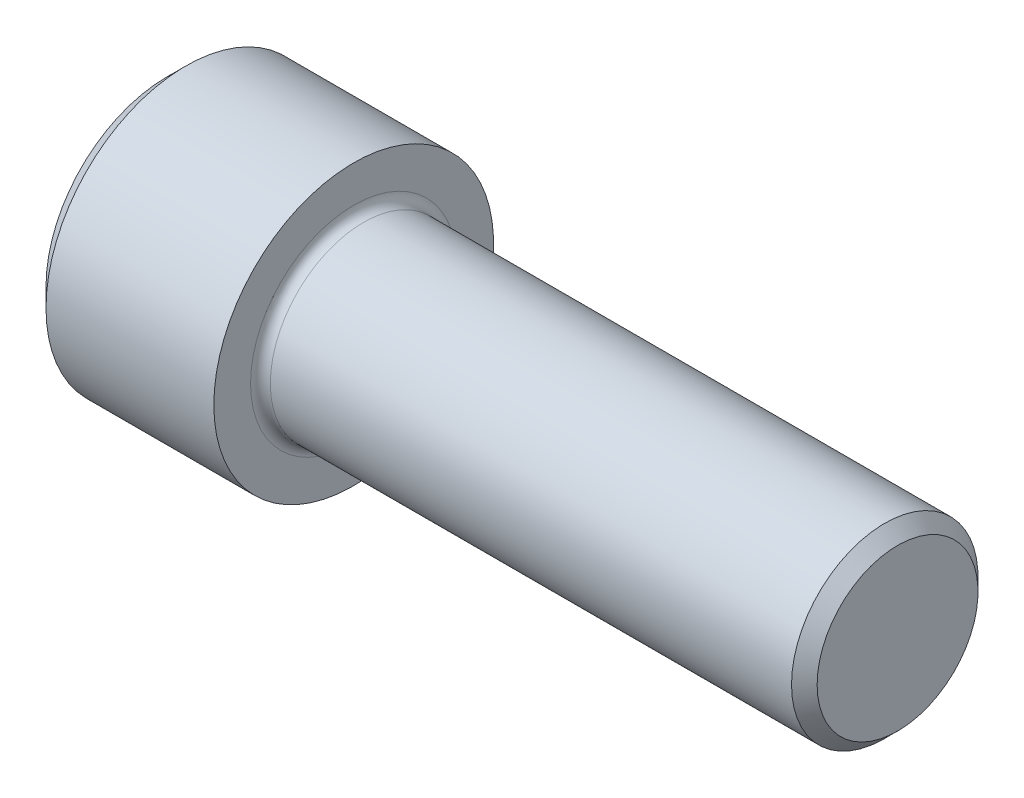
ISO-10303-21;
HEADER;
FILE_DESCRIPTION(('STEP AP214'),'2;1');
FILE_NAME('part.step','',(''),(''),'','','');
FILE_SCHEMA(('AUTOMOTIVE_DESIGN { 1 0 10303 214 1 1 1 1 }'));
ENDSEC;
DATA;
#1=APPLICATION_CONTEXT('core data for automotive mechanical design processes');
#2=APPLICATION_PROTOCOL_DEFINITION('international standard','automotive_design',2000,#1);
#3=PRODUCT_CONTEXT('',#1,'mechanical');
#4=PRODUCT('Part','Part','',(#3));
#5=PRODUCT_RELATED_PRODUCT_CATEGORY('part','',(#4));
#6=PRODUCT_DEFINITION_FORMATION('','',#4);
#7=PRODUCT_DEFINITION_CONTEXT('part definition',#1,'design');
#8=PRODUCT_DEFINITION('design','',#6,#7);
#9=PRODUCT_DEFINITION_SHAPE('','',#8);
#10=(LENGTH_UNIT() NAMED_UNIT(*) SI_UNIT(.MILLI.,.METRE.));
#11=(NAMED_UNIT(*) PLANE_ANGLE_UNIT() SI_UNIT($,.RADIAN.));
#12=(NAMED_UNIT(*) SI_UNIT($,.STERADIAN.) SOLID_ANGLE_UNIT());
#13=UNCERTAINTY_MEASURE_WITH_UNIT(LENGTH_MEASURE(1.E-05),#10,'distance_accuracy_value','');
#14=(GEOMETRIC_REPRESENTATION_CONTEXT(3) GLOBAL_UNCERTAINTY_ASSIGNED_CONTEXT((#13)) GLOBAL_UNIT_ASSIGNED_CONTEXT((#10,
#11,#12)) REPRESENTATION_CONTEXT('',''));
#15=CARTESIAN_POINT('',(0.,0.,0.));
#16=DIRECTION('',(0.,0.,1.));
#17=DIRECTION('',(1.,0.,0.));
#18=AXIS2_PLACEMENT_3D('',#15,#16,#17);
#19=CARTESIAN_POINT('',(0.,0.,0.));
#20=DIRECTION('',(-1.,0.,0.));
#21=DIRECTION('',(0.,0.,1.));
#22=AXIS2_PLACEMENT_3D('',#19,#20,#21);
#23=PLANE('',#22);
#24=DIRECTION('',(0.,-0.499999999999999,0.866025403784439));
#25=VECTOR('',#24,1.);
#26=CARTESIAN_POINT('',(0.,10.9696551146029,0.));
#27=LINE('',#26,#25);
#28=CARTESIAN_POINT('',(0.,10.9696551146029,0.));
#29=VERTEX_POINT('',#28);
#30=CARTESIAN_POINT('',(0.,5.48482755730145,9.49999999999999));
#31=VERTEX_POINT('',#30);
#32=EDGE_CURVE('E429',#29,#31,#27,.T.);
#33=ORIENTED_EDGE('',*,*,#32,.T.);
#34=DIRECTION('',(0.,1.,0.));
#35=VECTOR('',#34,1.);
#36=CARTESIAN_POINT('',(0.,-5.48482755730143,9.5));
#37=LINE('',#36,#35);
#38=CARTESIAN_POINT('',(0.,-5.48482755730143,9.5));
#39=VERTEX_POINT('',#38);
#40=EDGE_CURVE('E130',#39,#31,#37,.T.);
#41=ORIENTED_EDGE('',*,*,#40,.F.);
#42=DIRECTION('',(0.,-0.500000000000001,-0.866025403784438));
#43=VECTOR('',#42,1.);
#44=CARTESIAN_POINT('',(0.,-5.48482755730143,9.5));
#45=LINE('',#44,#43);
#46=CARTESIAN_POINT('',(0.,-10.9696551146029,0.));
#47=VERTEX_POINT('',#46);
#48=EDGE_CURVE('E432',#39,#47,#45,.T.);
#49=ORIENTED_EDGE('',*,*,#48,.T.);
#50=DIRECTION('',(0.,0.499999999999999,-0.866025403784439));
#51=VECTOR('',#50,1.);
#52=CARTESIAN_POINT('',(0.,-10.9696551146029,0.));
#53=LINE('',#52,#51);
#54=CARTESIAN_POINT('',(0.,-5.48482755730146,-9.49999999999999));
#55=VERTEX_POINT('',#54);
#56=EDGE_CURVE('E435',#47,#55,#53,.T.);
#57=ORIENTED_EDGE('',*,*,#56,.T.);
#58=DIRECTION('',(0.,-1.,0.));
#59=VECTOR('',#58,1.);
#60=CARTESIAN_POINT('',(0.,5.48482755730143,-9.50000000000001));
#61=LINE('',#60,#59);
#62=CARTESIAN_POINT('',(0.,5.48482755730143,-9.50000000000001));
#63=VERTEX_POINT('',#62);
#64=EDGE_CURVE('E438',#63,#55,#61,.T.);
#65=ORIENTED_EDGE('',*,*,#64,.F.);
#66=DIRECTION('',(0.,-0.500000000000001,-0.866025403784438));
#67=VECTOR('',#66,1.);
#68=CARTESIAN_POINT('',(0.,10.9696551146029,0.));
#69=LINE('',#68,#67);
#70=EDGE_CURVE('E125',#29,#63,#69,.T.);
#71=ORIENTED_EDGE('',*,*,#70,.F.);
#72=EDGE_LOOP('',(#33,#41,#49,#57,#65,#71));
#73=FACE_BOUND('',#72,.T.);
#74=CARTESIAN_POINT('',(0.,0.,0.));
#75=DIRECTION('',(-1.,0.,0.));
#76=DIRECTION('',(0.,0.,1.));
#77=AXIS2_PLACEMENT_3D('',#74,#75,#76);
#78=CIRCLE('',#77,15.6);
#79=CARTESIAN_POINT('',(0.,0.,15.6));
#80=VERTEX_POINT('',#79);
#81=EDGE_CURVE('E141',#80,#80,#78,.T.);
#82=ORIENTED_EDGE('',*,*,#81,.T.);
#83=EDGE_LOOP('',(#82));
#84=FACE_BOUND('',#83,.T.);
#85=ADVANCED_FACE('F38',(#73,#84),#23,.T.);
#86=CARTESIAN_POINT('',(94.,10.352,0.));
#87=DIRECTION('',(1.,0.,0.));
#88=DIRECTION('',(0.,0.,-1.));
#89=AXIS2_PLACEMENT_3D('',#86,#87,#88);
#90=PLANE('',#89);
#91=CARTESIAN_POINT('',(94.,0.,0.));
#92=DIRECTION('',(-1.,0.,0.));
#93=DIRECTION('',(0.,0.,1.));
#94=AXIS2_PLACEMENT_3D('',#91,#92,#93);
#95=CIRCLE('',#94,10.352);
#96=CARTESIAN_POINT('',(94.,0.,10.352));
#97=VERTEX_POINT('',#96);
#98=EDGE_CURVE('E154',#97,#97,#95,.T.);
#99=ORIENTED_EDGE('',*,*,#98,.F.);
#100=EDGE_LOOP('',(#99));
#101=FACE_BOUND('',#100,.T.);
#102=ADVANCED_FACE('F175',(#101),#90,.T.);
#103=CARTESIAN_POINT('',(94.,0.,0.));
#104=DIRECTION('',(-1.,0.,0.));
#105=DIRECTION('',(0.,0.,1.));
#106=AXIS2_PLACEMENT_3D('',#103,#104,#105);
#107=CONICAL_SURFACE('',#106,10.352,0.78539816339734);
#108=CARTESIAN_POINT('',(92.3519999999997,0.,0.));
#109=DIRECTION('',(-1.,0.,0.));
#110=DIRECTION('',(0.,0.,1.));
#111=AXIS2_PLACEMENT_3D('',#108,#109,#110);
#112=CIRCLE('',#111,12.);
#113=CARTESIAN_POINT('',(92.3519999999997,0.,12.));
#114=VERTEX_POINT('',#113);
#115=EDGE_CURVE('E151',#114,#114,#112,.T.);
#116=ORIENTED_EDGE('',*,*,#115,.F.);
#117=EDGE_LOOP('',(#116));
#118=FACE_BOUND('',#117,.T.);
#119=ORIENTED_EDGE('',*,*,#98,.T.);
#120=EDGE_LOOP('',(#119));
#121=FACE_BOUND('',#120,.T.);
#122=ADVANCED_FACE('F181',(#118,#121),#107,.T.);
#123=CARTESIAN_POINT('',(-31.75,0.,0.));
#124=DIRECTION('',(-1.,0.,0.));
#125=DIRECTION('',(0.,0.,1.));
#126=AXIS2_PLACEMENT_3D('',#123,#124,#125);
#127=CYLINDRICAL_SURFACE('',#126,12.);
#128=CARTESIAN_POINT('',(25.27,0.,0.));
#129=DIRECTION('',(1.,0.,0.));
#130=DIRECTION('',(0.,0.,-1.));
#131=AXIS2_PLACEMENT_3D('',#128,#129,#130);
#132=CIRCLE('',#131,12.);
#133=CARTESIAN_POINT('',(25.27,0.,-12.));
#134=VERTEX_POINT('',#133);
#135=EDGE_CURVE('E11',#134,#134,#132,.T.);
#136=ORIENTED_EDGE('',*,*,#135,.T.);
#137=EDGE_LOOP('',(#136));
#138=FACE_BOUND('',#137,.T.);
#139=ORIENTED_EDGE('',*,*,#115,.T.);
#140=EDGE_LOOP('',(#139));
#141=FACE_BOUND('',#140,.T.);
#142=ADVANCED_FACE('F192',(#138,#141),#127,.T.);
#143=CARTESIAN_POINT('',(24.,18.,0.));
#144=DIRECTION('',(1.,0.,0.));
#145=DIRECTION('',(0.,0.,-1.));
#146=AXIS2_PLACEMENT_3D('',#143,#144,#145);
#147=PLANE('',#146);
#148=CARTESIAN_POINT('',(24.,0.,0.));
#149=DIRECTION('',(1.,0.,0.));
#150=DIRECTION('',(0.,0.,-1.));
#151=AXIS2_PLACEMENT_3D('',#148,#149,#150);
#152=CIRCLE('',#151,13.27);
#153=CARTESIAN_POINT('',(24.,0.,-13.27));
#154=VERTEX_POINT('',#153);
#155=EDGE_CURVE('E46',#154,#154,#152,.F.);
#156=ORIENTED_EDGE('',*,*,#155,.T.);
#157=EDGE_LOOP('',(#156));
#158=FACE_BOUND('',#157,.T.);
#159=CARTESIAN_POINT('',(24.,0.,0.));
#160=DIRECTION('',(-1.,0.,0.));
#161=DIRECTION('',(0.,0.,1.));
#162=AXIS2_PLACEMENT_3D('',#159,#160,#161);
#163=CIRCLE('',#162,18.);
#164=CARTESIAN_POINT('',(24.,0.,18.));
#165=VERTEX_POINT('',#164);
#166=EDGE_CURVE('E148',#165,#165,#163,.T.);
#167=ORIENTED_EDGE('',*,*,#166,.F.);
#168=EDGE_LOOP('',(#167));
#169=FACE_BOUND('',#168,.T.);
#170=ADVANCED_FACE('F159',(#158,#169),#147,.T.);
#171=CARTESIAN_POINT('',(-31.75,0.,0.));
#172=DIRECTION('',(-1.,0.,0.));
#173=DIRECTION('',(0.,0.,1.));
#174=AXIS2_PLACEMENT_3D('',#171,#172,#173);
#175=CYLINDRICAL_SURFACE('',#174,18.);
#176=ORIENTED_EDGE('',*,*,#166,.T.);
#177=EDGE_LOOP('',(#176));
#178=FACE_BOUND('',#177,.T.);
#179=CARTESIAN_POINT('',(2.4,0.,0.));
#180=DIRECTION('',(-1.,0.,0.));
#181=DIRECTION('',(0.,0.,1.));
#182=AXIS2_PLACEMENT_3D('',#179,#180,#181);
#183=CIRCLE('',#182,18.);
#184=CARTESIAN_POINT('',(2.4,0.,18.));
#185=VERTEX_POINT('',#184);
#186=EDGE_CURVE('E145',#185,#185,#183,.T.);
#187=ORIENTED_EDGE('',*,*,#186,.F.);
#188=EDGE_LOOP('',(#187));
#189=FACE_BOUND('',#188,.T.);
#190=ADVANCED_FACE('F170',(#178,#189),#175,.T.);
#191=CARTESIAN_POINT('',(0.,0.,0.));
#192=DIRECTION('',(1.,0.,0.));
#193=DIRECTION('',(0.,0.,-1.));
#194=AXIS2_PLACEMENT_3D('',#191,#192,#193);
#195=CONICAL_SURFACE('',#194,15.6,0.785398163397449);
#196=ORIENTED_EDGE('',*,*,#186,.T.);
#197=EDGE_LOOP('',(#196));
#198=FACE_BOUND('',#197,.T.);
#199=ORIENTED_EDGE('',*,*,#81,.F.);
#200=EDGE_LOOP('',(#199));
#201=FACE_BOUND('',#200,.T.);
#202=ADVANCED_FACE('F163',(#198,#201),#195,.T.);
#203=CARTESIAN_POINT('',(25.27,0.,0.));
#204=DIRECTION('',(1.,0.,0.));
#205=DIRECTION('',(0.,0.,-1.));
#206=AXIS2_PLACEMENT_3D('',#203,#204,#205);
#207=TOROIDAL_SURFACE('',#206,13.27,1.27);
#208=ORIENTED_EDGE('',*,*,#135,.F.);
#209=EDGE_LOOP('',(#208));
#210=FACE_BOUND('',#209,.T.);
#211=ORIENTED_EDGE('',*,*,#155,.F.);
#212=EDGE_LOOP('',(#211));
#213=FACE_BOUND('',#212,.T.);
#214=ADVANCED_FACE('F40',(#210,#213),#207,.F.);
#215=CARTESIAN_POINT('',(12.,10.9696551146029,0.));
#216=DIRECTION('',(0.,-0.866025403784439,-0.499999999999999));
#217=DIRECTION('',(0.,0.499999999999999,-0.866025403784439));
#218=AXIS2_PLACEMENT_3D('',#215,#216,#217);
#219=PLANE('',#218);
#220=ORIENTED_EDGE('',*,*,#32,.F.);
#221=DIRECTION('',(-1.,0.,0.));
#222=VECTOR('',#221,1.);
#223=CARTESIAN_POINT('',(12.,10.9696551146029,0.));
#224=LINE('',#223,#222);
#225=CARTESIAN_POINT('',(12.,10.9696551146029,0.));
#226=VERTEX_POINT('',#225);
#227=EDGE_CURVE('E428',#226,#29,#224,.T.);
#228=ORIENTED_EDGE('',*,*,#227,.F.);
#229=DIRECTION('',(0.,-0.499999999999999,0.866025403784439));
#230=VECTOR('',#229,1.);
#231=CARTESIAN_POINT('',(12.,10.9696551146029,0.));
#232=LINE('',#231,#230);
#233=CARTESIAN_POINT('',(12.,8.22724133595217,4.74999999999999));
#234=VERTEX_POINT('',#233);
#235=EDGE_CURVE('E53',#226,#234,#232,.T.);
#236=ORIENTED_EDGE('',*,*,#235,.T.);
#237=CARTESIAN_POINT('',(12.,5.48482755730145,9.49999999999999));
#238=VERTEX_POINT('',#237);
#239=EDGE_CURVE('E111',#234,#238,#232,.T.);
#240=ORIENTED_EDGE('',*,*,#239,.T.);
#241=DIRECTION('',(-1.,0.,0.));
#242=VECTOR('',#241,1.);
#243=CARTESIAN_POINT('',(12.,5.48482755730145,9.49999999999999));
#244=LINE('',#243,#242);
#245=EDGE_CURVE('E123',#238,#31,#244,.T.);
#246=ORIENTED_EDGE('',*,*,#245,.T.);
#247=EDGE_LOOP('',(#220,#228,#236,#240,#246));
#248=FACE_BOUND('',#247,.T.);
#249=ADVANCED_FACE('F122',(#248),#219,.T.);
#250=CARTESIAN_POINT('',(12.,-5.48482755730143,9.5));
#251=DIRECTION('',(0.,0.,1.));
#252=DIRECTION('',(0.,-1.,0.));
#253=AXIS2_PLACEMENT_3D('',#250,#251,#252);
#254=PLANE('',#253);
#255=ORIENTED_EDGE('',*,*,#40,.T.);
#256=ORIENTED_EDGE('',*,*,#245,.F.);
#257=DIRECTION('',(0.,1.,0.));
#258=VECTOR('',#257,1.);
#259=CARTESIAN_POINT('',(12.,-5.48482755730143,9.5));
#260=LINE('',#259,#258);
#261=CARTESIAN_POINT('',(12.,0.,9.5));
#262=VERTEX_POINT('',#261);
#263=EDGE_CURVE('E109',#262,#238,#260,.T.);
#264=ORIENTED_EDGE('',*,*,#263,.F.);
#265=CARTESIAN_POINT('',(12.,-5.48482755730143,9.5));
#266=VERTEX_POINT('',#265);
#267=EDGE_CURVE('E119',#266,#262,#260,.T.);
#268=ORIENTED_EDGE('',*,*,#267,.F.);
#269=DIRECTION('',(-1.,0.,0.));
#270=VECTOR('',#269,1.);
#271=CARTESIAN_POINT('',(12.,-5.48482755730143,9.5));
#272=LINE('',#271,#270);
#273=EDGE_CURVE('E132',#266,#39,#272,.T.);
#274=ORIENTED_EDGE('',*,*,#273,.T.);
#275=EDGE_LOOP('',(#255,#256,#264,#268,#274));
#276=FACE_BOUND('',#275,.T.);
#277=ADVANCED_FACE('F127',(#276),#254,.F.);
#278=CARTESIAN_POINT('',(12.,-5.48482755730143,9.5));
#279=DIRECTION('',(0.,0.866025403784438,-0.500000000000001));
#280=DIRECTION('',(0.,0.500000000000001,0.866025403784438));
#281=AXIS2_PLACEMENT_3D('',#278,#279,#280);
#282=PLANE('',#281);
#283=ORIENTED_EDGE('',*,*,#48,.F.);
#284=ORIENTED_EDGE('',*,*,#273,.F.);
#285=DIRECTION('',(0.,-0.500000000000001,-0.866025403784438));
#286=VECTOR('',#285,1.);
#287=CARTESIAN_POINT('',(12.,-5.48482755730143,9.5));
#288=LINE('',#287,#286);
#289=CARTESIAN_POINT('',(12.,-8.22724133595216,4.75000000000001));
#290=VERTEX_POINT('',#289);
#291=EDGE_CURVE('E409',#266,#290,#288,.T.);
#292=ORIENTED_EDGE('',*,*,#291,.T.);
#293=CARTESIAN_POINT('',(12.,-10.9696551146029,0.));
#294=VERTEX_POINT('',#293);
#295=EDGE_CURVE('E411',#290,#294,#288,.T.);
#296=ORIENTED_EDGE('',*,*,#295,.T.);
#297=DIRECTION('',(-1.,0.,0.));
#298=VECTOR('',#297,1.);
#299=CARTESIAN_POINT('',(12.,-10.9696551146029,0.));
#300=LINE('',#299,#298);
#301=EDGE_CURVE('E137',#294,#47,#300,.T.);
#302=ORIENTED_EDGE('',*,*,#301,.T.);
#303=EDGE_LOOP('',(#283,#284,#292,#296,#302));
#304=FACE_BOUND('',#303,.T.);
#305=ADVANCED_FACE('F275',(#304),#282,.T.);
#306=CARTESIAN_POINT('',(12.,-10.9696551146029,0.));
#307=DIRECTION('',(0.,0.866025403784439,0.499999999999999));
#308=DIRECTION('',(0.,-0.499999999999999,0.866025403784439));
#309=AXIS2_PLACEMENT_3D('',#306,#307,#308);
#310=PLANE('',#309);
#311=ORIENTED_EDGE('',*,*,#56,.F.);
#312=ORIENTED_EDGE('',*,*,#301,.F.);
#313=DIRECTION('',(0.,0.499999999999999,-0.866025403784439));
#314=VECTOR('',#313,1.);
#315=CARTESIAN_POINT('',(12.,-10.9696551146029,0.));
#316=LINE('',#315,#314);
#317=CARTESIAN_POINT('',(12.,-8.22724133595218,-4.74999999999999));
#318=VERTEX_POINT('',#317);
#319=EDGE_CURVE('E414',#294,#318,#316,.T.);
#320=ORIENTED_EDGE('',*,*,#319,.T.);
#321=CARTESIAN_POINT('',(12.,-5.48482755730146,-9.49999999999999));
#322=VERTEX_POINT('',#321);
#323=EDGE_CURVE('E418',#318,#322,#316,.T.);
#324=ORIENTED_EDGE('',*,*,#323,.T.);
#325=DIRECTION('',(-1.,0.,0.));
#326=VECTOR('',#325,1.);
#327=CARTESIAN_POINT('',(12.,-5.48482755730146,-9.49999999999999));
#328=LINE('',#327,#326);
#329=EDGE_CURVE('E447',#322,#55,#328,.T.);
#330=ORIENTED_EDGE('',*,*,#329,.T.);
#331=EDGE_LOOP('',(#311,#312,#320,#324,#330));
#332=FACE_BOUND('',#331,.T.);
#333=ADVANCED_FACE('F284',(#332),#310,.T.);
#334=CARTESIAN_POINT('',(12.,5.48482755730143,-9.50000000000001));
#335=DIRECTION('',(0.,0.,-1.));
#336=DIRECTION('',(0.,1.,0.));
#337=AXIS2_PLACEMENT_3D('',#334,#335,#336);
#338=PLANE('',#337);
#339=ORIENTED_EDGE('',*,*,#64,.T.);
#340=ORIENTED_EDGE('',*,*,#329,.F.);
#341=DIRECTION('',(0.,-1.,0.));
#342=VECTOR('',#341,1.);
#343=CARTESIAN_POINT('',(12.,5.48482755730143,-9.50000000000001));
#344=LINE('',#343,#342);
#345=CARTESIAN_POINT('',(12.,0.,-9.5));
#346=VERTEX_POINT('',#345);
#347=EDGE_CURVE('E422',#346,#322,#344,.T.);
#348=ORIENTED_EDGE('',*,*,#347,.F.);
#349=CARTESIAN_POINT('',(12.,5.48482755730143,-9.50000000000001));
#350=VERTEX_POINT('',#349);
#351=EDGE_CURVE('E423',#350,#346,#344,.T.);
#352=ORIENTED_EDGE('',*,*,#351,.F.);
#353=DIRECTION('',(-1.,0.,0.));
#354=VECTOR('',#353,1.);
#355=CARTESIAN_POINT('',(12.,5.48482755730143,-9.50000000000001));
#356=LINE('',#355,#354);
#357=EDGE_CURVE('E444',#350,#63,#356,.T.);
#358=ORIENTED_EDGE('',*,*,#357,.T.);
#359=EDGE_LOOP('',(#339,#340,#348,#352,#358));
#360=FACE_BOUND('',#359,.T.);
#361=ADVANCED_FACE('F294',(#360),#338,.F.);
#362=CARTESIAN_POINT('',(12.,10.9696551146029,0.));
#363=DIRECTION('',(0.,0.866025403784438,-0.500000000000001));
#364=DIRECTION('',(0.,0.500000000000001,0.866025403784438));
#365=AXIS2_PLACEMENT_3D('',#362,#363,#364);
#366=PLANE('',#365);
#367=ORIENTED_EDGE('',*,*,#70,.T.);
#368=ORIENTED_EDGE('',*,*,#357,.F.);
#369=DIRECTION('',(0.,-0.500000000000001,-0.866025403784438));
#370=VECTOR('',#369,1.);
#371=CARTESIAN_POINT('',(12.,10.9696551146029,0.));
#372=LINE('',#371,#370);
#373=CARTESIAN_POINT('',(12.,8.22724133595216,-4.75000000000001));
#374=VERTEX_POINT('',#373);
#375=EDGE_CURVE('E426',#374,#350,#372,.T.);
#376=ORIENTED_EDGE('',*,*,#375,.F.);
#377=EDGE_CURVE('E400',#226,#374,#372,.T.);
#378=ORIENTED_EDGE('',*,*,#377,.F.);
#379=ORIENTED_EDGE('',*,*,#227,.T.);
#380=EDGE_LOOP('',(#367,#368,#376,#378,#379));
#381=FACE_BOUND('',#380,.T.);
#382=ADVANCED_FACE('F304',(#381),#366,.F.);
#383=CARTESIAN_POINT('',(12.,5.48482755730145,9.49999999999999));
#384=DIRECTION('',(-1.,0.,0.));
#385=DIRECTION('',(0.,0.,1.));
#386=AXIS2_PLACEMENT_3D('',#383,#384,#385);
#387=PLANE('',#386);
#388=CARTESIAN_POINT('',(12.,0.,0.));
#389=DIRECTION('',(-1.,0.,0.));
#390=DIRECTION('',(0.,0.,1.));
#391=AXIS2_PLACEMENT_3D('',#388,#389,#390);
#392=CIRCLE('',#391,9.5);
#393=EDGE_CURVE('E131',#290,#262,#392,.T.);
#394=ORIENTED_EDGE('',*,*,#393,.F.);
#395=ORIENTED_EDGE('',*,*,#291,.F.);
#396=ORIENTED_EDGE('',*,*,#267,.T.);
#397=EDGE_LOOP('',(#394,#395,#396));
#398=FACE_BOUND('',#397,.T.);
#399=ADVANCED_FACE('F314',(#398),#387,.T.);
#400=EDGE_CURVE('E135',#318,#290,#392,.T.);
#401=ORIENTED_EDGE('',*,*,#400,.F.);
#402=ORIENTED_EDGE('',*,*,#319,.F.);
#403=ORIENTED_EDGE('',*,*,#295,.F.);
#404=EDGE_LOOP('',(#401,#402,#403));
#405=FACE_BOUND('',#404,.T.);
#406=ADVANCED_FACE('F324',(#405),#387,.T.);
#407=EDGE_CURVE('E453',#346,#318,#392,.T.);
#408=ORIENTED_EDGE('',*,*,#407,.F.);
#409=ORIENTED_EDGE('',*,*,#347,.T.);
#410=ORIENTED_EDGE('',*,*,#323,.F.);
#411=EDGE_LOOP('',(#408,#409,#410));
#412=FACE_BOUND('',#411,.T.);
#413=ADVANCED_FACE('F334',(#412),#387,.T.);
#414=EDGE_CURVE('E403',#374,#346,#392,.T.);
#415=ORIENTED_EDGE('',*,*,#414,.F.);
#416=ORIENTED_EDGE('',*,*,#375,.T.);
#417=ORIENTED_EDGE('',*,*,#351,.T.);
#418=EDGE_LOOP('',(#415,#416,#417));
#419=FACE_BOUND('',#418,.T.);
#420=ADVANCED_FACE('F343',(#419),#387,.T.);
#421=EDGE_CURVE('E142',#234,#374,#392,.T.);
#422=ORIENTED_EDGE('',*,*,#421,.F.);
#423=ORIENTED_EDGE('',*,*,#235,.F.);
#424=ORIENTED_EDGE('',*,*,#377,.T.);
#425=EDGE_LOOP('',(#422,#423,#424));
#426=FACE_BOUND('',#425,.T.);
#427=ADVANCED_FACE('F352',(#426),#387,.T.);
#428=EDGE_CURVE('E114',#262,#234,#392,.T.);
#429=ORIENTED_EDGE('',*,*,#428,.F.);
#430=ORIENTED_EDGE('',*,*,#263,.T.);
#431=ORIENTED_EDGE('',*,*,#239,.F.);
#432=EDGE_LOOP('',(#429,#430,#431));
#433=FACE_BOUND('',#432,.T.);
#434=ADVANCED_FACE('F110',(#433),#387,.T.);
#435=CARTESIAN_POINT('',(12.,0.,0.));
#436=DIRECTION('',(-1.,0.,0.));
#437=DIRECTION('',(0.,0.,1.));
#438=AXIS2_PLACEMENT_3D('',#435,#436,#437);
#439=CONICAL_SURFACE('',#438,9.5,1.04719755119659);
#440=CARTESIAN_POINT('',(17.4848275573015,0.,0.));
#441=VERTEX_POINT('',#440);
#442=VERTEX_LOOP('',#441);
#443=FACE_BOUND('',#442,.T.);
#444=ORIENTED_EDGE('',*,*,#428,.T.);
#445=ORIENTED_EDGE('',*,*,#421,.T.);
#446=ORIENTED_EDGE('',*,*,#414,.T.);
#447=ORIENTED_EDGE('',*,*,#407,.T.);
#448=ORIENTED_EDGE('',*,*,#400,.T.);
#449=ORIENTED_EDGE('',*,*,#393,.T.);
#450=EDGE_LOOP('',(#444,#445,#446,#447,#448,#449));
#451=FACE_BOUND('',#450,.T.);
#452=ADVANCED_FACE('F185',(#443,#451),#439,.F.);
#453=CLOSED_SHELL('',(#85,#102,#122,#142,#170,#190,#202,#214,#249,#277,#305,#333,#361,#382,#399,
#406,#413,#420,#427,#434,#452));
#454=MANIFOLD_SOLID_BREP('B2',#453);
#455=ADVANCED_BREP_SHAPE_REPRESENTATION('',(#18,#454),#14);
#456=SHAPE_DEFINITION_REPRESENTATION(#9,#455);
ENDSEC;
END-ISO-10303-21;
